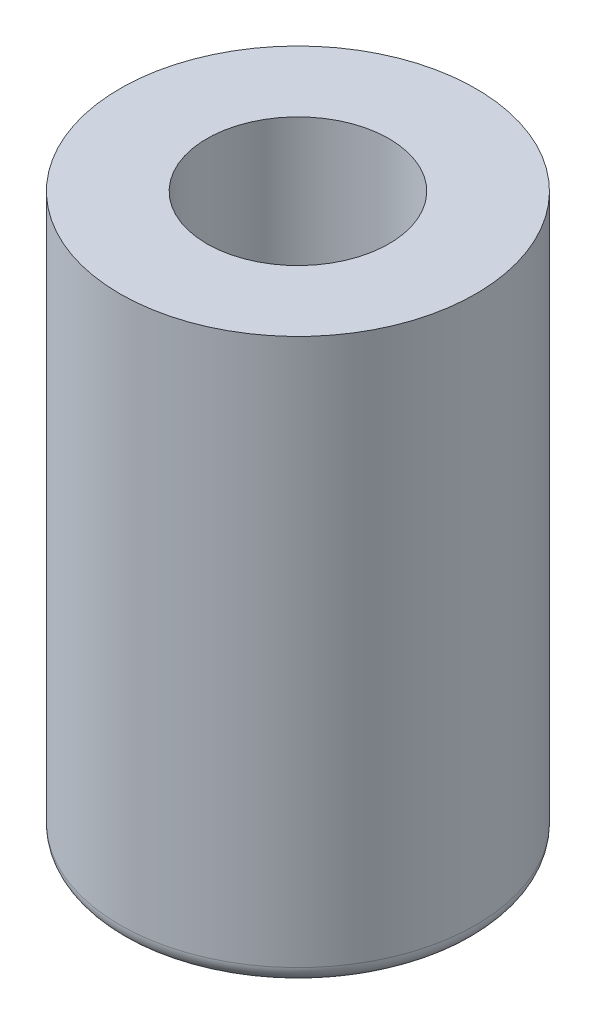
ISO-10303-21;
HEADER;
FILE_DESCRIPTION(('STEP AP214'),'2;1');
FILE_NAME('part.step','',(''),(''),'','','');
FILE_SCHEMA(('AUTOMOTIVE_DESIGN { 1 0 10303 214 1 1 1 1 }'));
ENDSEC;
DATA;
#1=APPLICATION_CONTEXT('core data for automotive mechanical design processes');
#2=APPLICATION_PROTOCOL_DEFINITION('international standard','automotive_design',2000,#1);
#3=PRODUCT_CONTEXT('',#1,'mechanical');
#4=PRODUCT('Part','Part','',(#3));
#5=PRODUCT_RELATED_PRODUCT_CATEGORY('part','',(#4));
#6=PRODUCT_DEFINITION_FORMATION('','',#4);
#7=PRODUCT_DEFINITION_CONTEXT('part definition',#1,'design');
#8=PRODUCT_DEFINITION('design','',#6,#7);
#9=PRODUCT_DEFINITION_SHAPE('','',#8);
#10=(LENGTH_UNIT() NAMED_UNIT(*) SI_UNIT(.MILLI.,.METRE.));
#11=(NAMED_UNIT(*) PLANE_ANGLE_UNIT() SI_UNIT($,.RADIAN.));
#12=(NAMED_UNIT(*) SI_UNIT($,.STERADIAN.) SOLID_ANGLE_UNIT());
#13=UNCERTAINTY_MEASURE_WITH_UNIT(LENGTH_MEASURE(1.E-05),#10,'distance_accuracy_value','');
#14=(GEOMETRIC_REPRESENTATION_CONTEXT(3) GLOBAL_UNCERTAINTY_ASSIGNED_CONTEXT((#13)) GLOBAL_UNIT_ASSIGNED_CONTEXT((#10,
#11,#12)) REPRESENTATION_CONTEXT('',''));
#15=CARTESIAN_POINT('',(0.,0.,0.));
#16=DIRECTION('',(0.,0.,1.));
#17=DIRECTION('',(1.,0.,0.));
#18=AXIS2_PLACEMENT_3D('',#15,#16,#17);
#19=CARTESIAN_POINT('',(0.,7.5,0.));
#20=DIRECTION('',(0.,-1.,0.));
#21=DIRECTION('',(0.,0.,-1.));
#22=AXIS2_PLACEMENT_3D('',#19,#20,#21);
#23=CYLINDRICAL_SURFACE('',#22,2.05);
#24=CARTESIAN_POINT('',(0.,0.2,0.));
#25=DIRECTION('',(0.,1.,0.));
#26=DIRECTION('',(0.,0.,1.));
#27=AXIS2_PLACEMENT_3D('',#24,#25,#26);
#28=CIRCLE('',#27,2.05);
#29=CARTESIAN_POINT('',(0.,0.2,2.05));
#30=VERTEX_POINT('',#29);
#31=EDGE_CURVE('E10',#30,#30,#28,.T.);
#32=ORIENTED_EDGE('',*,*,#31,.T.);
#33=EDGE_LOOP('',(#32));
#34=FACE_BOUND('',#33,.T.);
#35=CARTESIAN_POINT('',(0.,6.5,0.));
#36=DIRECTION('',(0.,1.,0.));
#37=DIRECTION('',(0.,0.,1.));
#38=AXIS2_PLACEMENT_3D('',#35,#36,#37);
#39=CIRCLE('',#38,2.05);
#40=CARTESIAN_POINT('',(0.,6.5,2.05));
#41=VERTEX_POINT('',#40);
#42=EDGE_CURVE('E53',#41,#41,#39,.T.);
#43=ORIENTED_EDGE('',*,*,#42,.F.);
#44=EDGE_LOOP('',(#43));
#45=FACE_BOUND('',#44,.T.);
#46=ADVANCED_FACE('F33',(#34,#45),#23,.T.);
#47=CARTESIAN_POINT('',(0.,7.5,0.));
#48=DIRECTION('',(0.,-1.,0.));
#49=DIRECTION('',(0.,0.,-1.));
#50=AXIS2_PLACEMENT_3D('',#47,#48,#49);
#51=CYLINDRICAL_SURFACE('',#50,1.05);
#52=CARTESIAN_POINT('',(0.,0.2,0.));
#53=DIRECTION('',(0.,1.,0.));
#54=DIRECTION('',(0.,0.,1.));
#55=AXIS2_PLACEMENT_3D('',#52,#53,#54);
#56=CIRCLE('',#55,1.05);
#57=CARTESIAN_POINT('',(0.,0.2,1.05));
#58=VERTEX_POINT('',#57);
#59=EDGE_CURVE('E41',#58,#58,#56,.F.);
#60=ORIENTED_EDGE('',*,*,#59,.T.);
#61=EDGE_LOOP('',(#60));
#62=FACE_BOUND('',#61,.T.);
#63=CARTESIAN_POINT('',(0.,6.5,0.));
#64=DIRECTION('',(0.,1.,0.));
#65=DIRECTION('',(0.,0.,1.));
#66=AXIS2_PLACEMENT_3D('',#63,#64,#65);
#67=CIRCLE('',#66,1.05);
#68=CARTESIAN_POINT('',(0.,6.5,1.05));
#69=VERTEX_POINT('',#68);
#70=EDGE_CURVE('E37',#69,#69,#67,.T.);
#71=ORIENTED_EDGE('',*,*,#70,.T.);
#72=EDGE_LOOP('',(#71));
#73=FACE_BOUND('',#72,.T.);
#74=ADVANCED_FACE('F60',(#62,#73),#51,.F.);
#75=CARTESIAN_POINT('',(0.,0.,0.));
#76=DIRECTION('',(0.,1.,0.));
#77=DIRECTION('',(0.,0.,1.));
#78=AXIS2_PLACEMENT_3D('',#75,#76,#77);
#79=PLANE('',#78);
#80=CARTESIAN_POINT('',(0.,0.,0.));
#81=DIRECTION('',(0.,1.,0.));
#82=DIRECTION('',(0.,0.,1.));
#83=AXIS2_PLACEMENT_3D('',#80,#81,#82);
#84=CIRCLE('',#83,1.25);
#85=CARTESIAN_POINT('',(0.,0.,1.25));
#86=VERTEX_POINT('',#85);
#87=EDGE_CURVE('E45',#86,#86,#84,.T.);
#88=ORIENTED_EDGE('',*,*,#87,.T.);
#89=EDGE_LOOP('',(#88));
#90=FACE_BOUND('',#89,.T.);
#91=CARTESIAN_POINT('',(0.,0.,0.));
#92=DIRECTION('',(0.,1.,0.));
#93=DIRECTION('',(0.,0.,1.));
#94=AXIS2_PLACEMENT_3D('',#91,#92,#93);
#95=CIRCLE('',#94,1.85);
#96=CARTESIAN_POINT('',(0.,0.,1.85));
#97=VERTEX_POINT('',#96);
#98=EDGE_CURVE('E50',#97,#97,#95,.F.);
#99=ORIENTED_EDGE('',*,*,#98,.T.);
#100=EDGE_LOOP('',(#99));
#101=FACE_BOUND('',#100,.T.);
#102=ADVANCED_FACE('F76',(#90,#101),#79,.F.);
#103=CARTESIAN_POINT('',(0.,0.2,0.));
#104=DIRECTION('',(0.,1.,0.));
#105=DIRECTION('',(0.,0.,1.));
#106=AXIS2_PLACEMENT_3D('',#103,#104,#105);
#107=TOROIDAL_SURFACE('',#106,1.25,0.2);
#108=ORIENTED_EDGE('',*,*,#59,.F.);
#109=EDGE_LOOP('',(#108));
#110=FACE_BOUND('',#109,.T.);
#111=ORIENTED_EDGE('',*,*,#87,.F.);
#112=EDGE_LOOP('',(#111));
#113=FACE_BOUND('',#112,.T.);
#114=ADVANCED_FACE('F68',(#110,#113),#107,.T.);
#115=CARTESIAN_POINT('',(0.,0.2,0.));
#116=DIRECTION('',(0.,1.,0.));
#117=DIRECTION('',(0.,0.,1.));
#118=AXIS2_PLACEMENT_3D('',#115,#116,#117);
#119=TOROIDAL_SURFACE('',#118,1.85,0.2);
#120=ORIENTED_EDGE('',*,*,#98,.F.);
#121=EDGE_LOOP('',(#120));
#122=FACE_BOUND('',#121,.T.);
#123=ORIENTED_EDGE('',*,*,#31,.F.);
#124=EDGE_LOOP('',(#123));
#125=FACE_BOUND('',#124,.T.);
#126=ADVANCED_FACE('F35',(#122,#125),#119,.T.);
#127=CARTESIAN_POINT('',(0.,6.5,0.));
#128=DIRECTION('',(0.,1.,0.));
#129=DIRECTION('',(0.,0.,1.));
#130=AXIS2_PLACEMENT_3D('',#127,#128,#129);
#131=PLANE('',#130);
#132=ORIENTED_EDGE('',*,*,#70,.F.);
#133=EDGE_LOOP('',(#132));
#134=FACE_BOUND('',#133,.T.);
#135=ORIENTED_EDGE('',*,*,#42,.T.);
#136=EDGE_LOOP('',(#135));
#137=FACE_BOUND('',#136,.T.);
#138=ADVANCED_FACE('F62',(#134,#137),#131,.T.);
#139=CLOSED_SHELL('',(#46,#74,#102,#114,#126,#138));
#140=MANIFOLD_SOLID_BREP('B2',#139);
#141=ADVANCED_BREP_SHAPE_REPRESENTATION('',(#18,#140),#14);
#142=SHAPE_DEFINITION_REPRESENTATION(#9,#141);
ENDSEC;
END-ISO-10303-21;
